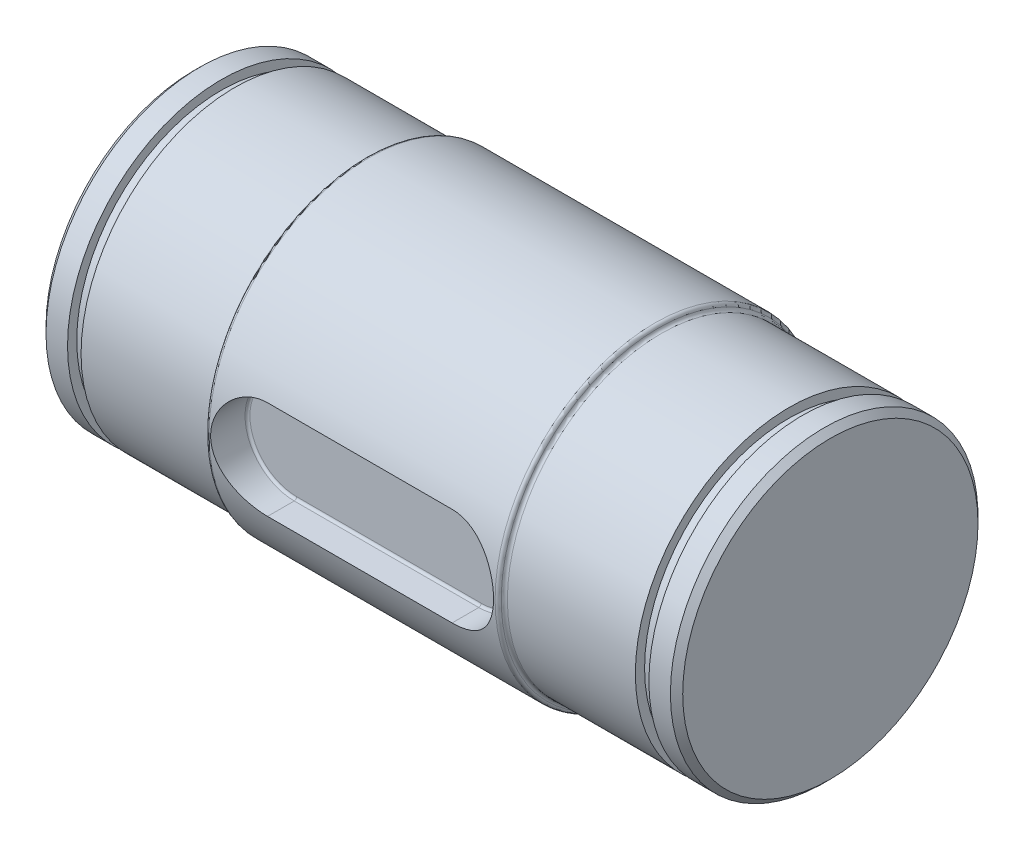
ISO-10303-21;
HEADER;
FILE_DESCRIPTION(('STEP AP214'),'2;1');
FILE_NAME('part.step','',(''),(''),'','','');
FILE_SCHEMA(('AUTOMOTIVE_DESIGN { 1 0 10303 214 1 1 1 1 }'));
ENDSEC;
DATA;
#1=APPLICATION_CONTEXT('core data for automotive mechanical design processes');
#2=APPLICATION_PROTOCOL_DEFINITION('international standard','automotive_design',2000,#1);
#3=PRODUCT_CONTEXT('',#1,'mechanical');
#4=PRODUCT('Part','Part','',(#3));
#5=PRODUCT_RELATED_PRODUCT_CATEGORY('part','',(#4));
#6=PRODUCT_DEFINITION_FORMATION('','',#4);
#7=PRODUCT_DEFINITION_CONTEXT('part definition',#1,'design');
#8=PRODUCT_DEFINITION('design','',#6,#7);
#9=PRODUCT_DEFINITION_SHAPE('','',#8);
#10=(LENGTH_UNIT() NAMED_UNIT(*) SI_UNIT(.MILLI.,.METRE.));
#11=(NAMED_UNIT(*) PLANE_ANGLE_UNIT() SI_UNIT($,.RADIAN.));
#12=(NAMED_UNIT(*) SI_UNIT($,.STERADIAN.) SOLID_ANGLE_UNIT());
#13=UNCERTAINTY_MEASURE_WITH_UNIT(LENGTH_MEASURE(1.E-05),#10,'distance_accuracy_value','');
#14=(GEOMETRIC_REPRESENTATION_CONTEXT(3) GLOBAL_UNCERTAINTY_ASSIGNED_CONTEXT((#13)) GLOBAL_UNIT_ASSIGNED_CONTEXT((#10,
#11,#12)) REPRESENTATION_CONTEXT('',''));
#15=CARTESIAN_POINT('',(0.,0.,0.));
#16=DIRECTION('',(0.,0.,1.));
#17=DIRECTION('',(1.,0.,0.));
#18=AXIS2_PLACEMENT_3D('',#15,#16,#17);
#19=CARTESIAN_POINT('',(51.75,0.,0.));
#20=DIRECTION('',(-1.,0.,0.));
#21=DIRECTION('',(0.,0.,1.));
#22=AXIS2_PLACEMENT_3D('',#19,#20,#21);
#23=PLANE('',#22);
#24=CARTESIAN_POINT('',(51.75,0.,0.));
#25=DIRECTION('',(-1.,0.,0.));
#26=DIRECTION('',(0.,0.,1.));
#27=AXIS2_PLACEMENT_3D('',#24,#25,#26);
#28=CIRCLE('',#27,24.000008612981);
#29=CARTESIAN_POINT('',(51.75,0.,24.000008612981));
#30=VERTEX_POINT('',#29);
#31=EDGE_CURVE('E27',#30,#30,#28,.T.);
#32=ORIENTED_EDGE('',*,*,#31,.F.);
#33=EDGE_LOOP('',(#32));
#34=FACE_BOUND('',#33,.T.);
#35=ADVANCED_FACE('F24',(#34),#23,.F.);
#36=CARTESIAN_POINT('',(-51.75,0.,-2.35922392732846E-13));
#37=DIRECTION('',(-1.,0.,0.));
#38=DIRECTION('',(0.,0.,1.));
#39=AXIS2_PLACEMENT_3D('',#36,#37,#38);
#40=PLANE('',#39);
#41=CARTESIAN_POINT('',(-51.75,0.,-2.63677968348475E-13));
#42=DIRECTION('',(-1.,0.,0.));
#43=DIRECTION('',(0.,0.,1.));
#44=AXIS2_PLACEMENT_3D('',#41,#42,#43);
#45=CIRCLE('',#44,24.0000096194053);
#46=CARTESIAN_POINT('',(-51.75,0.,24.000009619405));
#47=VERTEX_POINT('',#46);
#48=EDGE_CURVE('E192',#47,#47,#45,.F.);
#49=ORIENTED_EDGE('',*,*,#48,.F.);
#50=EDGE_LOOP('',(#49));
#51=FACE_BOUND('',#50,.T.);
#52=ADVANCED_FACE('F429',(#51),#40,.T.);
#53=CARTESIAN_POINT('',(50.7500044859261,0.,0.));
#54=DIRECTION('',(-1.,0.,0.));
#55=DIRECTION('',(0.,0.,1.));
#56=AXIS2_PLACEMENT_3D('',#53,#54,#55);
#57=CONICAL_SURFACE('',#56,25.0000044859245,0.785398342833002);
#58=ORIENTED_EDGE('',*,*,#31,.T.);
#59=EDGE_LOOP('',(#58));
#60=FACE_BOUND('',#59,.T.);
#61=CARTESIAN_POINT('',(50.7500044865,0.,0.));
#62=DIRECTION('',(-1.,0.,0.));
#63=DIRECTION('',(0.,0.,1.));
#64=AXIS2_PLACEMENT_3D('',#61,#62,#63);
#65=CIRCLE('',#64,25.);
#66=CARTESIAN_POINT('',(50.7500044865,0.,25.));
#67=VERTEX_POINT('',#66);
#68=EDGE_CURVE('E188',#67,#67,#65,.T.);
#69=ORIENTED_EDGE('',*,*,#68,.F.);
#70=EDGE_LOOP('',(#69));
#71=FACE_BOUND('',#70,.T.);
#72=ADVANCED_FACE('F421',(#60,#71),#57,.T.);
#73=CARTESIAN_POINT('',(-50.7500050101063,0.,-2.63677968348475E-13));
#74=DIRECTION('',(1.,0.,0.));
#75=DIRECTION('',(0.,0.,-1.));
#76=AXIS2_PLACEMENT_3D('',#73,#74,#75);
#77=CONICAL_SURFACE('',#76,25.0000050101042,0.785398363801);
#78=CARTESIAN_POINT('',(-50.7500100202085,0.,-2.63677968348475E-13));
#79=DIRECTION('',(1.,0.,0.));
#80=DIRECTION('',(0.,0.,-1.));
#81=AXIS2_PLACEMENT_3D('',#78,#79,#80);
#82=CIRCLE('',#81,25.);
#83=CARTESIAN_POINT('',(-50.7500100202085,0.,-25.0000000000003));
#84=VERTEX_POINT('',#83);
#85=EDGE_CURVE('E191',#84,#84,#82,.T.);
#86=ORIENTED_EDGE('',*,*,#85,.F.);
#87=EDGE_LOOP('',(#86));
#88=FACE_BOUND('',#87,.T.);
#89=ORIENTED_EDGE('',*,*,#48,.T.);
#90=EDGE_LOOP('',(#89));
#91=FACE_BOUND('',#90,.T.);
#92=ADVANCED_FACE('F413',(#88,#91),#77,.T.);
#93=CARTESIAN_POINT('',(56.925,0.,-2.22044604925031E-13));
#94=DIRECTION('',(-1.,0.,0.));
#95=DIRECTION('',(0.,0.,1.));
#96=AXIS2_PLACEMENT_3D('',#93,#94,#95);
#97=CYLINDRICAL_SURFACE('',#96,25.);
#98=CARTESIAN_POINT('',(47.25,0.,0.));
#99=DIRECTION('',(-1.,0.,0.));
#100=DIRECTION('',(0.,0.,1.));
#101=AXIS2_PLACEMENT_3D('',#98,#99,#100);
#102=CIRCLE('',#101,25.);
#103=CARTESIAN_POINT('',(47.25,0.,25.));
#104=VERTEX_POINT('',#103);
#105=EDGE_CURVE('E460',#104,#104,#102,.T.);
#106=ORIENTED_EDGE('',*,*,#105,.F.);
#107=EDGE_LOOP('',(#106));
#108=FACE_BOUND('',#107,.T.);
#109=ORIENTED_EDGE('',*,*,#68,.T.);
#110=EDGE_LOOP('',(#109));
#111=FACE_BOUND('',#110,.T.);
#112=ADVANCED_FACE('F405',(#108,#111),#97,.T.);
#113=CARTESIAN_POINT('',(56.925,0.,-2.22044604925031E-13));
#114=DIRECTION('',(-1.,0.,0.));
#115=DIRECTION('',(0.,0.,1.));
#116=AXIS2_PLACEMENT_3D('',#113,#114,#115);
#117=CYLINDRICAL_SURFACE('',#116,25.);
#118=CARTESIAN_POINT('',(-47.25,0.,0.));
#119=DIRECTION('',(-1.,0.,0.));
#120=DIRECTION('',(0.,0.,1.));
#121=AXIS2_PLACEMENT_3D('',#118,#119,#120);
#122=CIRCLE('',#121,25.);
#123=CARTESIAN_POINT('',(-47.25,0.,25.));
#124=VERTEX_POINT('',#123);
#125=EDGE_CURVE('E463',#124,#124,#122,.T.);
#126=ORIENTED_EDGE('',*,*,#125,.T.);
#127=EDGE_LOOP('',(#126));
#128=FACE_BOUND('',#127,.T.);
#129=ORIENTED_EDGE('',*,*,#85,.T.);
#130=EDGE_LOOP('',(#129));
#131=FACE_BOUND('',#130,.T.);
#132=ADVANCED_FACE('F397',(#128,#131),#117,.T.);
#133=CARTESIAN_POINT('',(47.25,0.,0.));
#134=DIRECTION('',(-1.,0.,0.));
#135=DIRECTION('',(0.,0.,1.));
#136=AXIS2_PLACEMENT_3D('',#133,#134,#135);
#137=PLANE('',#136);
#138=CARTESIAN_POINT('',(47.25,0.,0.));
#139=DIRECTION('',(-1.,0.,0.));
#140=DIRECTION('',(0.,0.,1.));
#141=AXIS2_PLACEMENT_3D('',#138,#139,#140);
#142=CIRCLE('',#141,23.5);
#143=CARTESIAN_POINT('',(47.25,0.,23.5));
#144=VERTEX_POINT('',#143);
#145=EDGE_CURVE('E466',#144,#144,#142,.T.);
#146=ORIENTED_EDGE('',*,*,#145,.F.);
#147=EDGE_LOOP('',(#146));
#148=FACE_BOUND('',#147,.T.);
#149=ORIENTED_EDGE('',*,*,#105,.T.);
#150=EDGE_LOOP('',(#149));
#151=FACE_BOUND('',#150,.T.);
#152=ADVANCED_FACE('F389',(#148,#151),#137,.T.);
#153=CARTESIAN_POINT('',(-47.25,0.,0.));
#154=DIRECTION('',(-1.,0.,0.));
#155=DIRECTION('',(0.,0.,1.));
#156=AXIS2_PLACEMENT_3D('',#153,#154,#155);
#157=PLANE('',#156);
#158=CARTESIAN_POINT('',(-47.25,0.,0.));
#159=DIRECTION('',(-1.,0.,0.));
#160=DIRECTION('',(0.,0.,1.));
#161=AXIS2_PLACEMENT_3D('',#158,#159,#160);
#162=CIRCLE('',#161,23.5);
#163=CARTESIAN_POINT('',(-47.25,0.,23.5));
#164=VERTEX_POINT('',#163);
#165=EDGE_CURVE('E469',#164,#164,#162,.F.);
#166=ORIENTED_EDGE('',*,*,#165,.F.);
#167=EDGE_LOOP('',(#166));
#168=FACE_BOUND('',#167,.T.);
#169=ORIENTED_EDGE('',*,*,#125,.F.);
#170=EDGE_LOOP('',(#169));
#171=FACE_BOUND('',#170,.T.);
#172=ADVANCED_FACE('F381',(#168,#171),#157,.F.);
#173=CARTESIAN_POINT('',(56.925,0.,-2.22044604925031E-13));
#174=DIRECTION('',(-1.,0.,0.));
#175=DIRECTION('',(0.,0.,1.));
#176=AXIS2_PLACEMENT_3D('',#173,#174,#175);
#177=CYLINDRICAL_SURFACE('',#176,23.5);
#178=CARTESIAN_POINT('',(45.05,0.,0.));
#179=DIRECTION('',(-1.,0.,0.));
#180=DIRECTION('',(0.,0.,1.));
#181=AXIS2_PLACEMENT_3D('',#178,#179,#180);
#182=CIRCLE('',#181,23.5);
#183=CARTESIAN_POINT('',(45.05,0.,23.5));
#184=VERTEX_POINT('',#183);
#185=EDGE_CURVE('E472',#184,#184,#182,.F.);
#186=ORIENTED_EDGE('',*,*,#185,.T.);
#187=EDGE_LOOP('',(#186));
#188=FACE_BOUND('',#187,.T.);
#189=ORIENTED_EDGE('',*,*,#145,.T.);
#190=EDGE_LOOP('',(#189));
#191=FACE_BOUND('',#190,.T.);
#192=ADVANCED_FACE('F373',(#188,#191),#177,.T.);
#193=CARTESIAN_POINT('',(56.925,0.,-2.22044604925031E-13));
#194=DIRECTION('',(-1.,0.,0.));
#195=DIRECTION('',(0.,0.,1.));
#196=AXIS2_PLACEMENT_3D('',#193,#194,#195);
#197=CYLINDRICAL_SURFACE('',#196,23.5);
#198=ORIENTED_EDGE('',*,*,#165,.T.);
#199=EDGE_LOOP('',(#198));
#200=FACE_BOUND('',#199,.T.);
#201=CARTESIAN_POINT('',(-45.05,0.,0.));
#202=DIRECTION('',(-1.,0.,0.));
#203=DIRECTION('',(0.,0.,1.));
#204=AXIS2_PLACEMENT_3D('',#201,#202,#203);
#205=CIRCLE('',#204,23.5);
#206=CARTESIAN_POINT('',(-45.05,0.,23.5));
#207=VERTEX_POINT('',#206);
#208=EDGE_CURVE('E475',#207,#207,#205,.F.);
#209=ORIENTED_EDGE('',*,*,#208,.F.);
#210=EDGE_LOOP('',(#209));
#211=FACE_BOUND('',#210,.T.);
#212=ADVANCED_FACE('F365',(#200,#211),#197,.T.);
#213=CARTESIAN_POINT('',(45.05,0.,0.));
#214=DIRECTION('',(-1.,0.,0.));
#215=DIRECTION('',(0.,0.,1.));
#216=AXIS2_PLACEMENT_3D('',#213,#214,#215);
#217=PLANE('',#216);
#218=ORIENTED_EDGE('',*,*,#185,.F.);
#219=EDGE_LOOP('',(#218));
#220=FACE_BOUND('',#219,.T.);
#221=CARTESIAN_POINT('',(45.05,0.,0.));
#222=DIRECTION('',(-1.,0.,0.));
#223=DIRECTION('',(0.,0.,1.));
#224=AXIS2_PLACEMENT_3D('',#221,#222,#223);
#225=CIRCLE('',#224,25.);
#226=CARTESIAN_POINT('',(45.05,0.,25.));
#227=VERTEX_POINT('',#226);
#228=EDGE_CURVE('E96',#227,#227,#225,.T.);
#229=ORIENTED_EDGE('',*,*,#228,.F.);
#230=EDGE_LOOP('',(#229));
#231=FACE_BOUND('',#230,.T.);
#232=ADVANCED_FACE('F357',(#220,#231),#217,.F.);
#233=CARTESIAN_POINT('',(-45.05,0.,0.));
#234=DIRECTION('',(-1.,0.,0.));
#235=DIRECTION('',(0.,0.,1.));
#236=AXIS2_PLACEMENT_3D('',#233,#234,#235);
#237=PLANE('',#236);
#238=ORIENTED_EDGE('',*,*,#208,.T.);
#239=EDGE_LOOP('',(#238));
#240=FACE_BOUND('',#239,.T.);
#241=CARTESIAN_POINT('',(-45.05,0.,0.));
#242=DIRECTION('',(-1.,0.,0.));
#243=DIRECTION('',(0.,0.,1.));
#244=AXIS2_PLACEMENT_3D('',#241,#242,#243);
#245=CIRCLE('',#244,25.);
#246=CARTESIAN_POINT('',(-45.05,0.,25.));
#247=VERTEX_POINT('',#246);
#248=EDGE_CURVE('E95',#247,#247,#245,.F.);
#249=ORIENTED_EDGE('',*,*,#248,.F.);
#250=EDGE_LOOP('',(#249));
#251=FACE_BOUND('',#250,.T.);
#252=ADVANCED_FACE('F349',(#240,#251),#237,.T.);
#253=CARTESIAN_POINT('',(56.925,0.,-2.22044604925031E-13));
#254=DIRECTION('',(-1.,0.,0.));
#255=DIRECTION('',(0.,0.,1.));
#256=AXIS2_PLACEMENT_3D('',#253,#254,#255);
#257=CYLINDRICAL_SURFACE('',#256,25.);
#258=ORIENTED_EDGE('',*,*,#228,.T.);
#259=EDGE_LOOP('',(#258));
#260=FACE_BOUND('',#259,.T.);
#261=CARTESIAN_POINT('',(24.25,0.,-2.08166817117217E-13));
#262=DIRECTION('',(-1.,0.,0.));
#263=DIRECTION('',(0.,1.,-5.23143334207887E-12));
#264=AXIS2_PLACEMENT_3D('',#261,#262,#263);
#265=CIRCLE('',#264,25.);
#266=CARTESIAN_POINT('',(24.25,25.,-1.30994000369089E-10));
#267=VERTEX_POINT('',#266);
#268=EDGE_CURVE('E185',#267,#267,#265,.F.);
#269=ORIENTED_EDGE('',*,*,#268,.T.);
#270=EDGE_LOOP('',(#269));
#271=FACE_BOUND('',#270,.T.);
#272=ADVANCED_FACE('F343',(#260,#271),#257,.T.);
#273=CARTESIAN_POINT('',(3.88578058618805E-13,0.,20.0000000000001));
#274=DIRECTION('',(0.,0.,1.));
#275=DIRECTION('',(1.,0.,0.));
#276=AXIS2_PLACEMENT_3D('',#273,#274,#275);
#277=PLANE('',#276);
#278=DIRECTION('',(1.,0.,0.));
#279=VECTOR('',#278,1.);
#280=CARTESIAN_POINT('',(-15.2773739955,7.5999999999995,20.0000000000002));
#281=LINE('',#280,#279);
#282=CARTESIAN_POINT('',(15.,7.5999999999995,20.0000000000001));
#283=VERTEX_POINT('',#282);
#284=CARTESIAN_POINT('',(-15.,7.5999999999995,20.0000000000002));
#285=VERTEX_POINT('',#284);
#286=EDGE_CURVE('E84',#283,#285,#281,.F.);
#287=ORIENTED_EDGE('',*,*,#286,.T.);
#288=CARTESIAN_POINT('',(-15.,-4.9960036108132E-13,20.0000000000001));
#289=DIRECTION('',(0.,0.,-1.));
#290=DIRECTION('',(0.,-1.,0.));
#291=AXIS2_PLACEMENT_3D('',#288,#289,#290);
#292=CIRCLE('',#291,7.60000000000039);
#293=CARTESIAN_POINT('',(-15.,-7.6,20.0000000000003));
#294=VERTEX_POINT('',#293);
#295=EDGE_CURVE('E88',#285,#294,#292,.F.);
#296=ORIENTED_EDGE('',*,*,#295,.T.);
#297=DIRECTION('',(-1.,0.,0.));
#298=VECTOR('',#297,1.);
#299=CARTESIAN_POINT('',(15.2773739955,-7.6,20.0000000000002));
#300=LINE('',#299,#298);
#301=CARTESIAN_POINT('',(15.,-7.6,20.0000000000002));
#302=VERTEX_POINT('',#301);
#303=EDGE_CURVE('E151',#294,#302,#300,.F.);
#304=ORIENTED_EDGE('',*,*,#303,.T.);
#305=CARTESIAN_POINT('',(15.,-4.9960036108132E-13,20.0000000000002));
#306=DIRECTION('',(0.,0.,-1.));
#307=DIRECTION('',(0.,1.,0.));
#308=AXIS2_PLACEMENT_3D('',#305,#306,#307);
#309=CIRCLE('',#308,7.59999999999962);
#310=EDGE_CURVE('E91',#302,#283,#309,.F.);
#311=ORIENTED_EDGE('',*,*,#310,.T.);
#312=EDGE_LOOP('',(#287,#296,#304,#311));
#313=FACE_BOUND('',#312,.T.);
#314=ADVANCED_FACE('F86',(#313),#277,.T.);
#315=CARTESIAN_POINT('',(-15.2773739955,7.6,20.4));
#316=DIRECTION('',(1.,0.,0.));
#317=DIRECTION('',(0.,0.,-1.));
#318=AXIS2_PLACEMENT_3D('',#315,#316,#317);
#319=CYLINDRICAL_SURFACE('',#318,0.4);
#320=DIRECTION('',(1.,0.,0.));
#321=VECTOR('',#320,1.);
#322=CARTESIAN_POINT('',(15.,7.99999999999923,20.4000000000001));
#323=LINE('',#322,#321);
#324=CARTESIAN_POINT('',(15.,7.99999999999923,20.4000000000001));
#325=VERTEX_POINT('',#324);
#326=CARTESIAN_POINT('',(-15.,7.99999999999923,20.4000000000002));
#327=VERTEX_POINT('',#326);
#328=EDGE_CURVE('E102',#325,#327,#323,.F.);
#329=ORIENTED_EDGE('',*,*,#328,.T.);
#330=CARTESIAN_POINT('',(-15.,7.6,20.4));
#331=DIRECTION('',(-1.,0.,0.));
#332=DIRECTION('',(0.,1.,0.));
#333=AXIS2_PLACEMENT_3D('',#330,#331,#332);
#334=CIRCLE('',#333,0.4);
#335=EDGE_CURVE('E99',#327,#285,#334,.T.);
#336=ORIENTED_EDGE('',*,*,#335,.T.);
#337=ORIENTED_EDGE('',*,*,#286,.F.);
#338=CARTESIAN_POINT('',(15.,7.6,20.3999999999999));
#339=DIRECTION('',(-1.,0.,0.));
#340=DIRECTION('',(0.,1.,0.));
#341=AXIS2_PLACEMENT_3D('',#338,#339,#340);
#342=CIRCLE('',#341,0.4);
#343=EDGE_CURVE('E156',#283,#325,#342,.F.);
#344=ORIENTED_EDGE('',*,*,#343,.T.);
#345=EDGE_LOOP('',(#329,#336,#337,#344));
#346=FACE_BOUND('',#345,.T.);
#347=ADVANCED_FACE('F100',(#346),#319,.F.);
#348=CARTESIAN_POINT('',(56.925,0.,-2.22044604925031E-13));
#349=DIRECTION('',(-1.,0.,0.));
#350=DIRECTION('',(0.,0.,1.));
#351=AXIS2_PLACEMENT_3D('',#348,#349,#350);
#352=CYLINDRICAL_SURFACE('',#351,25.);
#353=ORIENTED_EDGE('',*,*,#248,.T.);
#354=EDGE_LOOP('',(#353));
#355=FACE_BOUND('',#354,.T.);
#356=CARTESIAN_POINT('',(-24.25,0.,0.));
#357=DIRECTION('',(-1.,0.,0.));
#358=DIRECTION('',(0.,1.,9.13429921978182E-13));
#359=AXIS2_PLACEMENT_3D('',#356,#357,#358);
#360=CIRCLE('',#359,25.);
#361=CARTESIAN_POINT('',(-24.25,25.,2.28496258372624E-11));
#362=VERTEX_POINT('',#361);
#363=EDGE_CURVE('E182',#362,#362,#360,.T.);
#364=ORIENTED_EDGE('',*,*,#363,.T.);
#365=EDGE_LOOP('',(#364));
#366=FACE_BOUND('',#365,.T.);
#367=ADVANCED_FACE('F324',(#355,#366),#352,.T.);
#368=CARTESIAN_POINT('',(24.25,0.,-2.08166817117217E-13));
#369=DIRECTION('',(-1.,0.,0.));
#370=DIRECTION('',(0.,1.,-5.22457893941261E-12));
#371=AXIS2_PLACEMENT_3D('',#368,#369,#370);
#372=TOROIDAL_SURFACE('',#371,25.4999999999995,0.5);
#373=ORIENTED_EDGE('',*,*,#268,.F.);
#374=EDGE_LOOP('',(#373));
#375=FACE_BOUND('',#374,.T.);
#376=CARTESIAN_POINT('',(23.75,0.,-2.08166817117217E-13));
#377=DIRECTION('',(-1.,0.,0.));
#378=DIRECTION('',(0.,1.,-1.54597272483681E-11));
#379=AXIS2_PLACEMENT_3D('',#376,#377,#378);
#380=CIRCLE('',#379,25.5);
#381=CARTESIAN_POINT('',(23.75,25.5,-3.94431211650503E-10));
#382=VERTEX_POINT('',#381);
#383=EDGE_CURVE('E147',#382,#382,#380,.T.);
#384=ORIENTED_EDGE('',*,*,#383,.F.);
#385=EDGE_LOOP('',(#384));
#386=FACE_BOUND('',#385,.T.);
#387=ADVANCED_FACE('F162',(#375,#386),#372,.F.);
#388=CARTESIAN_POINT('',(15.,-4.9960036108132E-13,20.4000000000002));
#389=DIRECTION('',(0.,0.,1.));
#390=DIRECTION('',(-1.,-1.016474915934E-10,0.));
#391=AXIS2_PLACEMENT_3D('',#388,#389,#390);
#392=TOROIDAL_SURFACE('',#391,7.59999999999962,0.4);
#393=CARTESIAN_POINT('',(15.,-4.9960036108132E-13,20.4));
#394=DIRECTION('',(0.,0.,1.));
#395=DIRECTION('',(1.,0.,0.));
#396=AXIS2_PLACEMENT_3D('',#393,#394,#395);
#397=CIRCLE('',#396,8.);
#398=CARTESIAN_POINT('',(15.,-8.00000000000079,20.4));
#399=VERTEX_POINT('',#398);
#400=EDGE_CURVE('E143',#399,#325,#397,.T.);
#401=ORIENTED_EDGE('',*,*,#400,.T.);
#402=ORIENTED_EDGE('',*,*,#343,.F.);
#403=ORIENTED_EDGE('',*,*,#310,.F.);
#404=CARTESIAN_POINT('',(15.,-7.59999999999994,20.4000000000002));
#405=DIRECTION('',(-1.,0.,0.));
#406=DIRECTION('',(0.,0.,1.));
#407=AXIS2_PLACEMENT_3D('',#404,#405,#406);
#408=CIRCLE('',#407,0.4);
#409=EDGE_CURVE('E108',#302,#399,#408,.T.);
#410=ORIENTED_EDGE('',*,*,#409,.T.);
#411=EDGE_LOOP('',(#401,#402,#403,#410));
#412=FACE_BOUND('',#411,.T.);
#413=ADVANCED_FACE('F158',(#412),#392,.F.);
#414=CARTESIAN_POINT('',(15.2773739955,-7.59999999999994,20.4000000000002));
#415=DIRECTION('',(-1.,0.,0.));
#416=DIRECTION('',(0.,0.,1.));
#417=AXIS2_PLACEMENT_3D('',#414,#415,#416);
#418=CYLINDRICAL_SURFACE('',#417,0.4);
#419=DIRECTION('',(1.,0.,0.));
#420=VECTOR('',#419,1.);
#421=CARTESIAN_POINT('',(-15.,-8.00000000000079,20.4000000000001));
#422=LINE('',#421,#420);
#423=CARTESIAN_POINT('',(-15.,-8.00000000000079,20.4000000000001));
#424=VERTEX_POINT('',#423);
#425=EDGE_CURVE('E232',#424,#399,#422,.T.);
#426=ORIENTED_EDGE('',*,*,#425,.T.);
#427=ORIENTED_EDGE('',*,*,#409,.F.);
#428=ORIENTED_EDGE('',*,*,#303,.F.);
#429=CARTESIAN_POINT('',(-15.,-7.59999999999994,20.4000000000003));
#430=DIRECTION('',(1.,0.,0.));
#431=DIRECTION('',(0.,-1.,0.));
#432=AXIS2_PLACEMENT_3D('',#429,#430,#431);
#433=CIRCLE('',#432,0.4);
#434=EDGE_CURVE('E63',#294,#424,#433,.F.);
#435=ORIENTED_EDGE('',*,*,#434,.T.);
#436=EDGE_LOOP('',(#426,#427,#428,#435));
#437=FACE_BOUND('',#436,.T.);
#438=ADVANCED_FACE('F130',(#437),#418,.F.);
#439=CARTESIAN_POINT('',(-15.,-4.9960036108132E-13,20.4000000000001));
#440=DIRECTION('',(0.,0.,1.));
#441=DIRECTION('',(1.,1.01687664137044E-10,0.));
#442=AXIS2_PLACEMENT_3D('',#439,#440,#441);
#443=TOROIDAL_SURFACE('',#442,7.60000000000038,0.4);
#444=CARTESIAN_POINT('',(-15.,-4.9960036108132E-13,20.4000000000001));
#445=DIRECTION('',(0.,0.,1.));
#446=DIRECTION('',(1.,0.,0.));
#447=AXIS2_PLACEMENT_3D('',#444,#445,#446);
#448=CIRCLE('',#447,8.);
#449=EDGE_CURVE('E227',#327,#424,#448,.T.);
#450=ORIENTED_EDGE('',*,*,#449,.T.);
#451=ORIENTED_EDGE('',*,*,#434,.F.);
#452=ORIENTED_EDGE('',*,*,#295,.F.);
#453=ORIENTED_EDGE('',*,*,#335,.F.);
#454=EDGE_LOOP('',(#450,#451,#452,#453));
#455=FACE_BOUND('',#454,.T.);
#456=ADVANCED_FACE('F107',(#455),#443,.F.);
#457=CARTESIAN_POINT('',(15.,7.99999999999876,26.0000000000001));
#458=DIRECTION('',(0.,1.,0.));
#459=DIRECTION('',(0.,0.,1.));
#460=AXIS2_PLACEMENT_3D('',#457,#458,#459);
#461=PLANE('',#460);
#462=DIRECTION('',(-1.,0.,0.));
#463=VECTOR('',#462,1.);
#464=CARTESIAN_POINT('',(56.925,8.00000000000131,24.7386337537056));
#465=LINE('',#464,#463);
#466=CARTESIAN_POINT('',(-15.,8.00000000000009,24.7386337537058));
#467=VERTEX_POINT('',#466);
#468=CARTESIAN_POINT('',(15.,8.00000000000009,24.7386337537056));
#469=VERTEX_POINT('',#468);
#470=EDGE_CURVE('E181',#467,#469,#465,.F.);
#471=ORIENTED_EDGE('',*,*,#470,.F.);
#472=DIRECTION('',(0.,0.,1.));
#473=VECTOR('',#472,1.);
#474=CARTESIAN_POINT('',(-15.,7.99999999999881,26.0000000000003));
#475=LINE('',#474,#473);
#476=EDGE_CURVE('E178',#467,#327,#475,.F.);
#477=ORIENTED_EDGE('',*,*,#476,.T.);
#478=ORIENTED_EDGE('',*,*,#328,.F.);
#479=DIRECTION('',(0.,0.,1.));
#480=VECTOR('',#479,1.);
#481=CARTESIAN_POINT('',(15.,7.99999999999876,26.0000000000001));
#482=LINE('',#481,#480);
#483=EDGE_CURVE('E146',#325,#469,#482,.T.);
#484=ORIENTED_EDGE('',*,*,#483,.T.);
#485=EDGE_LOOP('',(#471,#477,#478,#484));
#486=FACE_BOUND('',#485,.T.);
#487=ADVANCED_FACE('F129',(#486),#461,.F.);
#488=CARTESIAN_POINT('',(-24.25,0.,0.));
#489=DIRECTION('',(-1.,0.,0.));
#490=DIRECTION('',(0.,1.,9.13212860451495E-13));
#491=AXIS2_PLACEMENT_3D('',#488,#489,#490);
#492=TOROIDAL_SURFACE('',#491,25.4999999999995,0.5);
#493=ORIENTED_EDGE('',*,*,#363,.F.);
#494=EDGE_LOOP('',(#493));
#495=FACE_BOUND('',#494,.T.);
#496=CARTESIAN_POINT('',(-23.75,0.,0.));
#497=DIRECTION('',(-1.,0.,0.));
#498=DIRECTION('',(0.,1.,-1.28839057478292E-11));
#499=AXIS2_PLACEMENT_3D('',#496,#497,#498);
#500=CIRCLE('',#499,25.5);
#501=CARTESIAN_POINT('',(-23.75,25.5,-3.28525718781836E-10));
#502=VERTEX_POINT('',#501);
#503=EDGE_CURVE('E169',#502,#502,#500,.F.);
#504=ORIENTED_EDGE('',*,*,#503,.F.);
#505=EDGE_LOOP('',(#504));
#506=FACE_BOUND('',#505,.T.);
#507=ADVANCED_FACE('F245',(#495,#506),#492,.F.);
#508=CARTESIAN_POINT('',(23.25,0.,-2.08166817117217E-13));
#509=DIRECTION('',(-1.,0.,0.));
#510=DIRECTION('',(0.,1.,-1.5458222936987E-11));
#511=AXIS2_PLACEMENT_3D('',#508,#509,#510);
#512=TOROIDAL_SURFACE('',#511,25.4999999999995,0.5);
#513=ORIENTED_EDGE('',*,*,#383,.T.);
#514=EDGE_LOOP('',(#513));
#515=FACE_BOUND('',#514,.T.);
#516=CARTESIAN_POINT('',(23.25,0.,-2.08166817117217E-13));
#517=DIRECTION('',(-1.,0.,0.));
#518=DIRECTION('',(0.,0.,1.));
#519=AXIS2_PLACEMENT_3D('',#516,#517,#518);
#520=CIRCLE('',#519,26.);
#521=CARTESIAN_POINT('',(23.25,0.,25.9999999999998));
#522=VERTEX_POINT('',#521);
#523=EDGE_CURVE('E177',#522,#522,#520,.T.);
#524=ORIENTED_EDGE('',*,*,#523,.F.);
#525=EDGE_LOOP('',(#524));
#526=FACE_BOUND('',#525,.T.);
#527=ADVANCED_FACE('F242',(#515,#526),#512,.T.);
#528=CARTESIAN_POINT('',(15.,-6.93889390390723E-13,26.0000000000001));
#529=DIRECTION('',(0.,0.,1.));
#530=DIRECTION('',(1.,0.,0.));
#531=AXIS2_PLACEMENT_3D('',#528,#529,#530);
#532=CYLINDRICAL_SURFACE('',#531,8.);
#533=CARTESIAN_POINT('',(15.,7.99999999999923,24.738633753706));
#534=CARTESIAN_POINT('',(15.2192705588559,8.00003002803085,24.7386012686902));
#535=CARTESIAN_POINT('',(15.4385292011944,7.99098645035708,24.7415479133923));
#536=CARTESIAN_POINT('',(15.8753670754415,7.95497468837174,24.7531621395127));
#537=CARTESIAN_POINT('',(16.0929466893541,7.92801071059955,24.7618283783404));
#538=CARTESIAN_POINT('',(16.5243086661961,7.85647453724732,24.7846147424266));
#539=CARTESIAN_POINT('',(16.7380994947821,7.81194872986675,24.7987204974571));
#540=CARTESIAN_POINT('',(17.1609660171612,7.7056956832933,24.8319425235332));
#541=CARTESIAN_POINT('',(17.370041577302,7.64396795717976,24.8510589364105));
#542=CARTESIAN_POINT('',(17.7819259738526,7.50387777626658,24.8937173687698));
#543=CARTESIAN_POINT('',(17.9847386151951,7.42552565853914,24.9172566370773));
#544=CARTESIAN_POINT('',(18.3829970861464,7.25275564566671,24.9680924942891));
#545=CARTESIAN_POINT('',(18.5784401491536,7.15833178898007,24.9953904767049));
#546=CARTESIAN_POINT('',(18.9607145898911,6.95411469713883,25.0529746731591));
#547=CARTESIAN_POINT('',(19.1475440728053,6.84431810152956,25.0832615401341));
#548=CARTESIAN_POINT('',(19.5114410126457,6.61012270031435,25.1459931100599));
#549=CARTESIAN_POINT('',(19.6885079266418,6.48572308378575,25.178437932801));
#550=CARTESIAN_POINT('',(20.0369763655413,6.21919710421781,25.2456140569198));
#551=CARTESIAN_POINT('',(20.2080500182666,6.07665181367205,25.2803847217888));
#552=CARTESIAN_POINT('',(20.5376821024351,5.77785117844693,25.3503446706512));
#553=CARTESIAN_POINT('',(20.6962403247891,5.62159560480863,25.3855339616271));
#554=CARTESIAN_POINT('',(20.9998998793103,5.29629358365511,25.45539143974));
#555=CARTESIAN_POINT('',(21.1449962502718,5.1272424618414,25.4900594308452));
#556=CARTESIAN_POINT('',(21.4207127076743,4.77745129335293,25.5579282045034));
#557=CARTESIAN_POINT('',(21.5513332056527,4.59671157920689,25.5911290287507));
#558=CARTESIAN_POINT('',(21.7999754970546,4.22046376048391,25.6558946570077));
#559=CARTESIAN_POINT('',(21.917646961318,4.02471460420708,25.6874057186763));
#560=CARTESIAN_POINT('',(22.1359668706178,3.62354913789848,25.7470580360842));
#561=CARTESIAN_POINT('',(22.236621844243,3.4181365741948,25.7752005829807));
#562=CARTESIAN_POINT('',(22.4200559171559,2.99916792684579,25.8273013235356));
#563=CARTESIAN_POINT('',(22.5028503862171,2.7856190326165,25.8512631115035));
#564=CARTESIAN_POINT('',(22.649921354537,2.3518422630001,25.8943308209309));
#565=CARTESIAN_POINT('',(22.7142024835504,2.13161607270183,25.9134379562847));
#566=CARTESIAN_POINT('',(22.8454431758837,1.59741783786029,25.9527560719794));
#567=CARTESIAN_POINT('',(22.903314691152,1.28097205456079,25.9703879749261));
#568=CARTESIAN_POINT('',(22.9805892392786,0.642981149249099,25.994007567369));
#569=CARTESIAN_POINT('',(22.9999938147905,0.321436232250614,25.9999957238183));
#570=CARTESIAN_POINT('',(23.0000042165041,-0.219125510161878,26.0000029151058));
#571=CARTESIAN_POINT('',(22.990993512199,-0.438200511782214,25.9972249702585));
#572=CARTESIAN_POINT('',(22.9550411980609,-0.874802538635386,25.9861956845291));
#573=CARTESIAN_POINT('',(22.9280961769278,-1.09232926141158,25.9779433023511));
#574=CARTESIAN_POINT('',(22.8564928823854,-1.52429991765171,25.956180853504));
#575=CARTESIAN_POINT('',(22.8118243552551,-1.73874199197791,25.9426677433895));
#576=CARTESIAN_POINT('',(22.7051519279834,-2.16298160545609,25.9107463484075));
#577=CARTESIAN_POINT('',(22.6431414905464,-2.37277736085957,25.892336217662));
#578=CARTESIAN_POINT('',(22.5024729356724,-2.78574605855147,25.8511622754658));
#579=CARTESIAN_POINT('',(22.4238516794594,-2.98893253412205,25.8284081144957));
#580=CARTESIAN_POINT('',(22.2504752944566,-3.38791056183351,25.7791094787742));
#581=CARTESIAN_POINT('',(22.1557141091467,-3.58369930414751,25.7525635817766));
#582=CARTESIAN_POINT('',(21.9508294897244,-3.96649458076805,25.6963875475728));
#583=CARTESIAN_POINT('',(21.8407122936842,-4.15350464021153,25.6667586640024));
#584=CARTESIAN_POINT('',(21.605805000966,-4.51777973159997,25.6051520411432));
#585=CARTESIAN_POINT('',(21.4810081783441,-4.69504024145808,25.5731732276962));
#586=CARTESIAN_POINT('',(21.2140598723134,-5.04330052954421,25.5068105357431));
#587=CARTESIAN_POINT('',(21.0715321722647,-5.21400410063626,25.4723851217543));
#588=CARTESIAN_POINT('',(20.7728454398209,-5.54288759643165,25.4028473693236));
#589=CARTESIAN_POINT('',(20.6166861545084,-5.70106728866574,25.3677350181458));
#590=CARTESIAN_POINT('',(20.2916530442585,-6.00398016693939,25.2977548558114));
#591=CARTESIAN_POINT('',(20.1227740000998,-6.14870777825218,25.2628871515249));
#592=CARTESIAN_POINT('',(19.7734660827854,-6.42366002689214,25.1943776155276));
#593=CARTESIAN_POINT('',(19.5930415117413,-6.55389001735636,25.1607353344464));
#594=CARTESIAN_POINT('',(19.2171197615747,-6.80204828924938,25.0948008983861));
#595=CARTESIAN_POINT('',(19.0213609095412,-6.91959491967961,25.0625623506487));
#596=CARTESIAN_POINT('',(18.620194188832,-7.13766781821808,25.0013304696347));
#597=CARTESIAN_POINT('',(18.4147900283403,-7.23820056005516,24.9723359034633));
#598=CARTESIAN_POINT('',(17.9957675740505,-7.42142942388062,24.9184974100842));
#599=CARTESIAN_POINT('',(17.7821538839748,-7.50413537561016,24.8936511971755));
#600=CARTESIAN_POINT('',(17.3482482024733,-7.6510279164917,24.8488962406669));
#601=CARTESIAN_POINT('',(17.1279579234481,-7.71521921057114,24.8289862428614));
#602=CARTESIAN_POINT('',(16.5942301599398,-7.84605964834557,24.7880189035356));
#603=CARTESIAN_POINT('',(16.2782991052982,-7.90370673421598,24.7696019645147));
#604=CARTESIAN_POINT('',(15.8008563566975,-7.96143261955253,24.7510794702746));
#605=CARTESIAN_POINT('',(15.6411049269819,-7.97588379664517,24.7464224496466));
#606=CARTESIAN_POINT('',(15.3209198755068,-7.99516840004566,24.7401968703125));
#607=CARTESIAN_POINT('',(15.1604860825557,-7.99999925036861,24.7386291388104));
#608=CARTESIAN_POINT('',(15.,-8.00000000000079,24.7386337537061));
#609=B_SPLINE_CURVE_WITH_KNOTS('',3,(#533,#534,#535,#536,#537,#538,#539,#540,#541,#542,#543,
#544,#545,#546,#547,#548,#549,#550,#551,#552,#553,#554,#555,#556,#557,#558,#559,#560,#561,#562,
#563,#564,#565,#566,#567,#568,#569,#570,#571,#572,#573,#574,#575,#576,#577,#578,#579,#580,#581,
#582,#583,#584,#585,#586,#587,#588,#589,#590,#591,#592,#593,#594,#595,#596,#597,#598,#599,#600,
#601,#602,#603,#604,#605,#606,#607,#608),.UNSPECIFIED.,.F.,.F.,(4,2,2,2,2,2,2,2,2,2,2,2,2,2,2,2,
2,2,2,2,2,2,2,2,2,2,2,2,2,2,2,2,2,2,2,2,2,4),(0.,0.657587079792114,1.31501985558433,
1.97072758041258,2.62645386770929,3.28177361207405,3.93733696815606,4.59304385367018,
5.24878716858773,5.92414436682789,6.59951284554345,7.27512924276005,7.95072642781642,
8.64155129592261,9.3321105159829,10.0220730867704,10.7118629638924,11.6757859872732,
12.6396703533205,13.2967576143526,13.9539698961852,14.6115629559637,15.2694042403117,
15.9258007543945,16.5824441266126,17.2388215234712,17.8955008408858,18.5698251206805,
19.2441619144044,19.9187769280668,20.5931420131759,21.2841043716794,21.9748032272705,
22.6651202497545,23.3552616946565,24.3173998928686,24.7985453681027,25.2798196598467),.UNSPECIFIED.);
#610=CARTESIAN_POINT('',(15.,-8.00000000000164,24.7386337537059));
#611=VERTEX_POINT('',#610);
#612=EDGE_CURVE('E200',#469,#611,#609,.T.);
#613=ORIENTED_EDGE('',*,*,#612,.F.);
#614=ORIENTED_EDGE('',*,*,#483,.F.);
#615=ORIENTED_EDGE('',*,*,#400,.F.);
#616=DIRECTION('',(0.,0.,-1.));
#617=VECTOR('',#616,1.);
#618=CARTESIAN_POINT('',(15.,-8.00000000000126,26.0000000000001));
#619=LINE('',#618,#617);
#620=EDGE_CURVE('E230',#399,#611,#619,.F.);
#621=ORIENTED_EDGE('',*,*,#620,.T.);
#622=EDGE_LOOP('',(#613,#614,#615,#621));
#623=FACE_BOUND('',#622,.T.);
#624=ADVANCED_FACE('F244',(#623),#532,.F.);
#625=CARTESIAN_POINT('',(-15.,-8.00000000000117,26.0000000000002));
#626=DIRECTION('',(0.,-1.,0.));
#627=DIRECTION('',(0.,0.,-1.));
#628=AXIS2_PLACEMENT_3D('',#625,#626,#627);
#629=PLANE('',#628);
#630=DIRECTION('',(-1.,0.,0.));
#631=VECTOR('',#630,1.);
#632=CARTESIAN_POINT('',(56.925,-8.00000000000253,24.7386337537057));
#633=LINE('',#632,#631);
#634=CARTESIAN_POINT('',(-15.,-8.0000000000012,24.7386337537059));
#635=VERTEX_POINT('',#634);
#636=EDGE_CURVE('E199',#611,#635,#633,.T.);
#637=ORIENTED_EDGE('',*,*,#636,.F.);
#638=ORIENTED_EDGE('',*,*,#620,.F.);
#639=ORIENTED_EDGE('',*,*,#425,.F.);
#640=DIRECTION('',(0.,0.,1.));
#641=VECTOR('',#640,1.);
#642=CARTESIAN_POINT('',(-15.,-8.00000000000117,26.0000000000002));
#643=LINE('',#642,#641);
#644=EDGE_CURVE('E42',#424,#635,#643,.T.);
#645=ORIENTED_EDGE('',*,*,#644,.T.);
#646=EDGE_LOOP('',(#637,#638,#639,#645));
#647=FACE_BOUND('',#646,.T.);
#648=ADVANCED_FACE('F264',(#647),#629,.F.);
#649=CARTESIAN_POINT('',(-15.,-6.93889390390723E-13,26.0000000000002));
#650=DIRECTION('',(0.,0.,1.));
#651=DIRECTION('',(1.,0.,0.));
#652=AXIS2_PLACEMENT_3D('',#649,#650,#651);
#653=CYLINDRICAL_SURFACE('',#652,8.);
#654=ORIENTED_EDGE('',*,*,#476,.F.);
#655=CARTESIAN_POINT('',(-15.,-8.00000000000079,24.7386337537062));
#656=CARTESIAN_POINT('',(-15.219270558856,-8.00003002803237,24.7386012686899));
#657=CARTESIAN_POINT('',(-15.4385292011945,-7.99098645035852,24.7415479133919));
#658=CARTESIAN_POINT('',(-15.8753670754416,-7.95497468837306,24.7531621395122));
#659=CARTESIAN_POINT('',(-16.0929466893542,-7.92801071060084,24.76182837834));
#660=CARTESIAN_POINT('',(-16.5243086661963,-7.85647453724876,24.7846147424261));
#661=CARTESIAN_POINT('',(-16.7380994947823,-7.81194872986836,24.7987204974565));
#662=CARTESIAN_POINT('',(-17.1609660171613,-7.70569568329438,24.8319425235329));
#663=CARTESIAN_POINT('',(-17.3700415773019,-7.64396795718015,24.8510589364107));
#664=CARTESIAN_POINT('',(-17.7819259738527,-7.50387777626692,24.89371736877));
#665=CARTESIAN_POINT('',(-17.9847386151955,-7.42552565854011,24.9172566370771));
#666=CARTESIAN_POINT('',(-18.382997086147,-7.25275564566809,24.9680924942886));
#667=CARTESIAN_POINT('',(-18.578440149154,-7.15833178898124,24.9953904767046));
#668=CARTESIAN_POINT('',(-18.9607145898915,-6.95411469713994,25.0529746731588));
#669=CARTESIAN_POINT('',(-19.1475440728059,-6.84431810153081,25.0832615401337));
#670=CARTESIAN_POINT('',(-19.511441012646,-6.61012270031531,25.1459931100596));
#671=CARTESIAN_POINT('',(-19.6885079266418,-6.48572308378628,25.1784379328009));
#672=CARTESIAN_POINT('',(-20.0369763655413,-6.21919710421827,25.2456140569197));
#673=CARTESIAN_POINT('',(-20.208050018267,-6.07665181367289,25.2803847217886));
#674=CARTESIAN_POINT('',(-20.5376821024356,-5.77785117844804,25.3503446706509));
#675=CARTESIAN_POINT('',(-20.6962403247895,-5.62159560480964,25.3855339616268));
#676=CARTESIAN_POINT('',(-20.9998998793107,-5.29629358365606,25.4553914397398));
#677=CARTESIAN_POINT('',(-21.1449962502722,-5.12724246184241,25.490059430845));
#678=CARTESIAN_POINT('',(-21.4207127076745,-4.77745129335386,25.5579282045033));
#679=CARTESIAN_POINT('',(-21.5513332056527,-4.59671157920768,25.5911290287506));
#680=CARTESIAN_POINT('',(-21.7999754970546,-4.2204637604847,25.6558946570077));
#681=CARTESIAN_POINT('',(-21.9176469613182,-4.024714604208,25.6874057186762));
#682=CARTESIAN_POINT('',(-22.1359668706181,-3.62354913789954,25.747058036084));
#683=CARTESIAN_POINT('',(-22.2366218442432,-3.41813657419586,25.7752005829806));
#684=CARTESIAN_POINT('',(-22.420055917156,-2.9991679268469,25.8273013235355));
#685=CARTESIAN_POINT('',(-22.5028503862172,-2.78561903261766,25.8512631115034));
#686=CARTESIAN_POINT('',(-22.6499213545371,-2.35184226300133,25.8943308209307));
#687=CARTESIAN_POINT('',(-22.7142024835504,-2.13161607270308,25.9134379562845));
#688=CARTESIAN_POINT('',(-22.8454431758837,-1.59741783786157,25.9527560719792));
#689=CARTESIAN_POINT('',(-22.903314691152,-1.28097205456211,25.970387974926));
#690=CARTESIAN_POINT('',(-22.9805892392786,-0.642981149250462,25.9940075673689));
#691=CARTESIAN_POINT('',(-22.9999938147905,-0.321436232251988,25.9999957238181));
#692=CARTESIAN_POINT('',(-23.0000042165041,0.21912551016054,26.0000029151057));
#693=CARTESIAN_POINT('',(-22.990993512199,0.438200511780925,25.9972249702585));
#694=CARTESIAN_POINT('',(-22.9550411980609,0.874802538634196,25.9861956845292));
#695=CARTESIAN_POINT('',(-22.9280961769278,1.09232926141044,25.9779433023512));
#696=CARTESIAN_POINT('',(-22.8564928823853,1.52429991765067,25.9561808535041));
#697=CARTESIAN_POINT('',(-22.811824355255,1.73874199197691,25.9426677433897));
#698=CARTESIAN_POINT('',(-22.7051519279833,2.16298160545521,25.9107463484075));
#699=CARTESIAN_POINT('',(-22.6431414905465,2.37277736085876,25.8923362176619));
#700=CARTESIAN_POINT('',(-22.5024729356723,2.78574605855069,25.8511622754657));
#701=CARTESIAN_POINT('',(-22.4238516794593,2.98893253412124,25.8284081144958));
#702=CARTESIAN_POINT('',(-22.2504752944563,3.3879105618327,25.7791094787743));
#703=CARTESIAN_POINT('',(-22.1557141091464,3.58369930414674,25.7525635817767));
#704=CARTESIAN_POINT('',(-21.9508294897241,3.96649458076726,25.6963875475729));
#705=CARTESIAN_POINT('',(-21.8407122936837,4.15350464021069,25.6667586640026));
#706=CARTESIAN_POINT('',(-21.6058050009657,4.51777973159928,25.6051520411432));
#707=CARTESIAN_POINT('',(-21.4810081783441,4.69504024145759,25.5731732276961));
#708=CARTESIAN_POINT('',(-21.2140598723134,5.04330052954366,25.506810535743));
#709=CARTESIAN_POINT('',(-21.0715321722644,5.21400410063544,25.4723851217544));
#710=CARTESIAN_POINT('',(-20.7728454398204,5.54288759643062,25.4028473693239));
#711=CARTESIAN_POINT('',(-20.616686154508,5.70106728866476,25.367735018146));
#712=CARTESIAN_POINT('',(-20.2916530442582,6.00398016693835,25.2977548558116));
#713=CARTESIAN_POINT('',(-20.1227740000993,6.14870777825101,25.2628871515251));
#714=CARTESIAN_POINT('',(-19.7734660827851,6.42366002689115,25.1943776155279));
#715=CARTESIAN_POINT('',(-19.5930415117413,6.55389001735567,25.1607353344466));
#716=CARTESIAN_POINT('',(-19.2171197615747,6.80204828924864,25.0948008983863));
#717=CARTESIAN_POINT('',(-19.021360909541,6.9195949196785,25.0625623506491));
#718=CARTESIAN_POINT('',(-18.6201941888317,7.13766781821671,25.0013304696351));
#719=CARTESIAN_POINT('',(-18.41479002834,7.23820056005391,24.9723359034636));
#720=CARTESIAN_POINT('',(-17.9957675740502,7.42142942387934,24.9184974100845));
#721=CARTESIAN_POINT('',(-17.7821538839745,7.50413537560873,24.893651197176));
#722=CARTESIAN_POINT('',(-17.3482482024731,7.65102791649054,24.8488962406672));
#723=CARTESIAN_POINT('',(-17.1279579234481,7.71521921057039,24.8289862428616));
#724=CARTESIAN_POINT('',(-16.5942301599399,7.84605964834496,24.7880189035357));
#725=CARTESIAN_POINT('',(-16.2782991052981,7.90370673421474,24.7696019645151));
#726=CARTESIAN_POINT('',(-15.8008563566974,7.96143261955107,24.7510794702751));
#727=CARTESIAN_POINT('',(-15.6411049269818,7.97588379664376,24.7464224496471));
#728=CARTESIAN_POINT('',(-15.3209198755068,7.9951684000443,24.7401968703129));
#729=CARTESIAN_POINT('',(-15.1604860825557,7.99999925036724,24.7386291388107));
#730=CARTESIAN_POINT('',(-15.,7.99999999999923,24.7386337537061));
#731=B_SPLINE_CURVE_WITH_KNOTS('',3,(#655,#656,#657,#658,#659,#660,#661,#662,#663,#664,#665,
#666,#667,#668,#669,#670,#671,#672,#673,#674,#675,#676,#677,#678,#679,#680,#681,#682,#683,#684,
#685,#686,#687,#688,#689,#690,#691,#692,#693,#694,#695,#696,#697,#698,#699,#700,#701,#702,#703,
#704,#705,#706,#707,#708,#709,#710,#711,#712,#713,#714,#715,#716,#717,#718,#719,#720,#721,#722,
#723,#724,#725,#726,#727,#728,#729,#730),.UNSPECIFIED.,.F.,.F.,(4,2,2,2,2,2,2,2,2,2,2,2,2,2,2,2,
2,2,2,2,2,2,2,2,2,2,2,2,2,2,2,2,2,2,2,2,2,4),(0.,0.657587079792279,1.31501985558442,
1.97072758041274,2.62645386770963,3.28177361207452,3.9373369681565,4.59304385367061,
5.24878716858819,5.92414436682839,6.59951284554388,7.27512924276046,7.95072642781682,
8.64155129592292,9.33211051598308,10.0220730867705,10.7118629638923,11.6757859872731,
12.6396703533203,13.2967576143526,13.9539698961854,14.611562955964,15.2694042403122,
15.9258007543949,16.5824441266131,17.2388215234718,17.8955008408864,18.569825120681,
19.2441619144048,19.9187769280672,20.5931420131762,21.2841043716796,21.9748032272708,
22.6651202497547,23.3552616946566,24.3173998928686,24.7985453681027,25.2798196598466),.UNSPECIFIED.);
#732=EDGE_CURVE('E33',#635,#467,#731,.T.);
#733=ORIENTED_EDGE('',*,*,#732,.F.);
#734=ORIENTED_EDGE('',*,*,#644,.F.);
#735=ORIENTED_EDGE('',*,*,#449,.F.);
#736=EDGE_LOOP('',(#654,#733,#734,#735));
#737=FACE_BOUND('',#736,.T.);
#738=ADVANCED_FACE('F206',(#737),#653,.F.);
#739=CARTESIAN_POINT('',(-23.25,0.,0.));
#740=DIRECTION('',(-1.,0.,0.));
#741=DIRECTION('',(0.,1.,-1.28894716251092E-11));
#742=AXIS2_PLACEMENT_3D('',#739,#740,#741);
#743=TOROIDAL_SURFACE('',#742,25.4999999999995,0.5);
#744=CARTESIAN_POINT('',(-23.25,0.,0.));
#745=DIRECTION('',(-1.,0.,0.));
#746=DIRECTION('',(0.,0.,1.));
#747=AXIS2_PLACEMENT_3D('',#744,#745,#746);
#748=CIRCLE('',#747,26.);
#749=CARTESIAN_POINT('',(-23.25,0.,26.));
#750=VERTEX_POINT('',#749);
#751=EDGE_CURVE('E13',#750,#750,#748,.F.);
#752=ORIENTED_EDGE('',*,*,#751,.F.);
#753=EDGE_LOOP('',(#752));
#754=FACE_BOUND('',#753,.T.);
#755=ORIENTED_EDGE('',*,*,#503,.T.);
#756=EDGE_LOOP('',(#755));
#757=FACE_BOUND('',#756,.T.);
#758=ADVANCED_FACE('F213',(#754,#757),#743,.T.);
#759=CARTESIAN_POINT('',(56.925,0.,-2.22044604925031E-13));
#760=DIRECTION('',(-1.,0.,0.));
#761=DIRECTION('',(0.,0.,1.));
#762=AXIS2_PLACEMENT_3D('',#759,#760,#761);
#763=CYLINDRICAL_SURFACE('',#762,26.);
#764=ORIENTED_EDGE('',*,*,#732,.T.);
#765=ORIENTED_EDGE('',*,*,#470,.T.);
#766=ORIENTED_EDGE('',*,*,#612,.T.);
#767=ORIENTED_EDGE('',*,*,#636,.T.);
#768=EDGE_LOOP('',(#764,#765,#766,#767));
#769=FACE_BOUND('',#768,.T.);
#770=ORIENTED_EDGE('',*,*,#523,.T.);
#771=EDGE_LOOP('',(#770));
#772=FACE_BOUND('',#771,.T.);
#773=ORIENTED_EDGE('',*,*,#751,.T.);
#774=EDGE_LOOP('',(#773));
#775=FACE_BOUND('',#774,.T.);
#776=ADVANCED_FACE('F210',(#769,#772,#775),#763,.T.);
#777=CLOSED_SHELL('',(#35,#52,#72,#92,#112,#132,#152,#172,#192,#212,#232,#252,#272,#314,#347,
#367,#387,#413,#438,#456,#487,#507,#527,#624,#648,#738,#758,#776));
#778=MANIFOLD_SOLID_BREP('B1',#777);
#779=ADVANCED_BREP_SHAPE_REPRESENTATION('',(#18,#778),#14);
#780=SHAPE_DEFINITION_REPRESENTATION(#9,#779);
ENDSEC;
END-ISO-10303-21;
